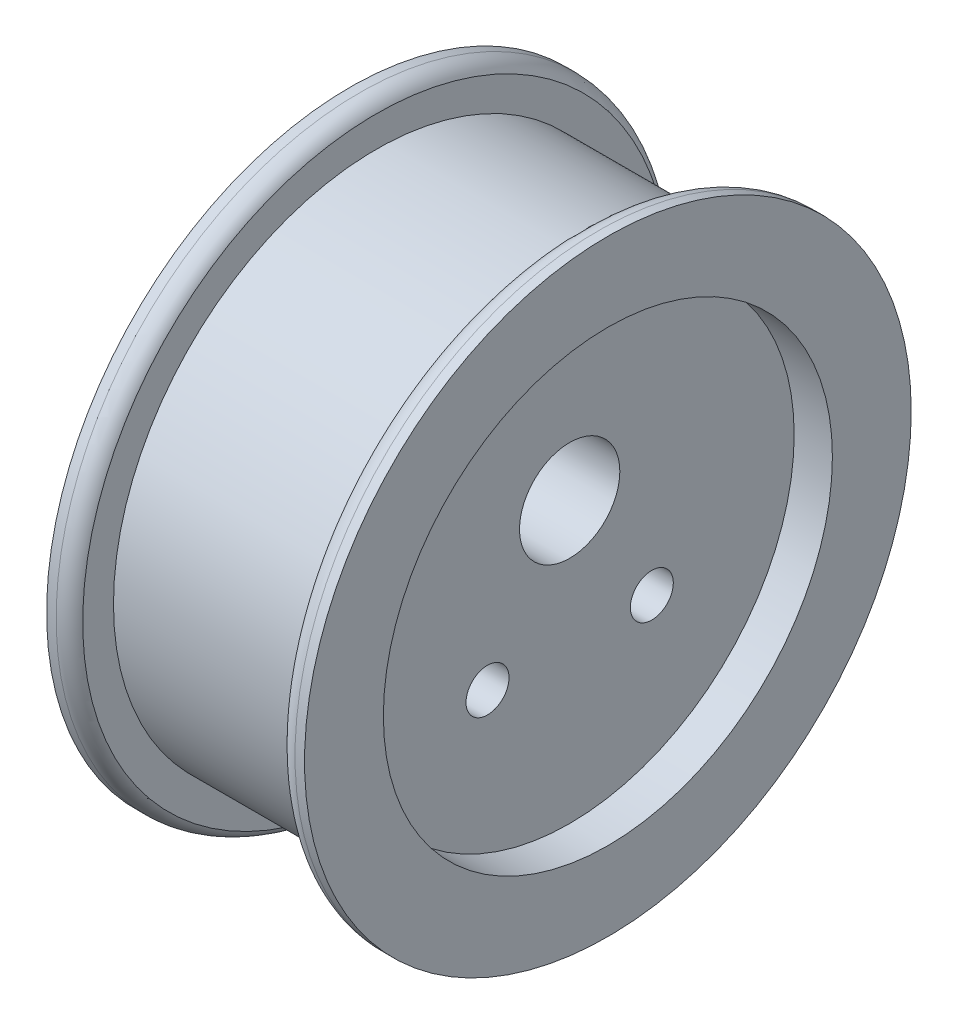
ISO-10303-21;
HEADER;
FILE_DESCRIPTION(('STEP AP214'),'2;1');
FILE_NAME('part.step','',(''),(''),'','','');
FILE_SCHEMA(('AUTOMOTIVE_DESIGN { 1 0 10303 214 1 1 1 1 }'));
ENDSEC;
DATA;
#1=APPLICATION_CONTEXT('core data for automotive mechanical design processes');
#2=APPLICATION_PROTOCOL_DEFINITION('international standard','automotive_design',2000,#1);
#3=PRODUCT_CONTEXT('',#1,'mechanical');
#4=PRODUCT('Part','Part','',(#3));
#5=PRODUCT_RELATED_PRODUCT_CATEGORY('part','',(#4));
#6=PRODUCT_DEFINITION_FORMATION('','',#4);
#7=PRODUCT_DEFINITION_CONTEXT('part definition',#1,'design');
#8=PRODUCT_DEFINITION('design','',#6,#7);
#9=PRODUCT_DEFINITION_SHAPE('','',#8);
#10=(LENGTH_UNIT() NAMED_UNIT(*) SI_UNIT(.MILLI.,.METRE.));
#11=(NAMED_UNIT(*) PLANE_ANGLE_UNIT() SI_UNIT($,.RADIAN.));
#12=(NAMED_UNIT(*) SI_UNIT($,.STERADIAN.) SOLID_ANGLE_UNIT());
#13=UNCERTAINTY_MEASURE_WITH_UNIT(LENGTH_MEASURE(1.E-05),#10,'distance_accuracy_value','');
#14=(GEOMETRIC_REPRESENTATION_CONTEXT(3) GLOBAL_UNCERTAINTY_ASSIGNED_CONTEXT((#13)) GLOBAL_UNIT_ASSIGNED_CONTEXT((#10,
#11,#12)) REPRESENTATION_CONTEXT('',''));
#15=CARTESIAN_POINT('',(0.,0.,0.));
#16=DIRECTION('',(0.,0.,1.));
#17=DIRECTION('',(1.,0.,0.));
#18=AXIS2_PLACEMENT_3D('',#15,#16,#17);
#19=CARTESIAN_POINT('',(3.,0.,0.));
#20=DIRECTION('',(1.,0.,0.));
#21=DIRECTION('',(0.,0.,-1.));
#22=AXIS2_PLACEMENT_3D('',#19,#20,#21);
#23=TOROIDAL_SURFACE('',#22,29.75,2.);
#24=CARTESIAN_POINT('',(3.,0.,0.));
#25=DIRECTION('',(1.,0.,0.));
#26=DIRECTION('',(0.,0.,-1.));
#27=AXIS2_PLACEMENT_3D('',#24,#25,#26);
#28=CIRCLE('',#27,31.75);
#29=CARTESIAN_POINT('',(3.,0.,-31.7500000000001));
#30=VERTEX_POINT('',#29);
#31=EDGE_CURVE('E104',#30,#30,#28,.T.);
#32=ORIENTED_EDGE('',*,*,#31,.F.);
#33=EDGE_LOOP('',(#32));
#34=FACE_BOUND('',#33,.T.);
#35=CARTESIAN_POINT('',(1.25,0.,0.));
#36=DIRECTION('',(-1.,0.,0.));
#37=DIRECTION('',(0.,0.,1.));
#38=AXIS2_PLACEMENT_3D('',#35,#36,#37);
#39=CIRCLE('',#38,30.7182458365519);
#40=CARTESIAN_POINT('',(1.25,0.,30.7182458365519));
#41=VERTEX_POINT('',#40);
#42=EDGE_CURVE('E48',#41,#41,#39,.F.);
#43=ORIENTED_EDGE('',*,*,#42,.T.);
#44=EDGE_LOOP('',(#43));
#45=FACE_BOUND('',#44,.T.);
#46=ADVANCED_FACE('F44',(#34,#45),#23,.T.);
#47=CARTESIAN_POINT('',(-22.,0.,0.));
#48=DIRECTION('',(1.,0.,0.));
#49=DIRECTION('',(0.,0.,-1.));
#50=AXIS2_PLACEMENT_3D('',#47,#48,#49);
#51=TOROIDAL_SURFACE('',#50,29.75,2.);
#52=CARTESIAN_POINT('',(-22.,0.,0.));
#53=DIRECTION('',(1.,0.,0.));
#54=DIRECTION('',(0.,0.,-1.));
#55=AXIS2_PLACEMENT_3D('',#52,#53,#54);
#56=CIRCLE('',#55,31.75);
#57=CARTESIAN_POINT('',(-22.,0.,-31.7500000000001));
#58=VERTEX_POINT('',#57);
#59=EDGE_CURVE('E101',#58,#58,#56,.T.);
#60=ORIENTED_EDGE('',*,*,#59,.T.);
#61=EDGE_LOOP('',(#60));
#62=FACE_BOUND('',#61,.T.);
#63=CARTESIAN_POINT('',(-20.25,0.,0.));
#64=DIRECTION('',(1.,0.,0.));
#65=DIRECTION('',(0.,0.,-1.));
#66=AXIS2_PLACEMENT_3D('',#63,#64,#65);
#67=CIRCLE('',#66,30.7182458365519);
#68=CARTESIAN_POINT('',(-20.25,0.,-30.7182458365519));
#69=VERTEX_POINT('',#68);
#70=EDGE_CURVE('E65',#69,#69,#67,.F.);
#71=ORIENTED_EDGE('',*,*,#70,.T.);
#72=EDGE_LOOP('',(#71));
#73=FACE_BOUND('',#72,.T.);
#74=ADVANCED_FACE('F128',(#62,#73),#51,.T.);
#75=CARTESIAN_POINT('',(0.,0.,0.));
#76=DIRECTION('',(1.,0.,0.));
#77=DIRECTION('',(0.,0.,-1.));
#78=AXIS2_PLACEMENT_3D('',#75,#76,#77);
#79=PLANE('',#78);
#80=CARTESIAN_POINT('',(0.,-7.09534799840619,-8.60000000000002));
#81=DIRECTION('',(1.,0.,0.));
#82=DIRECTION('',(0.,0.,-1.));
#83=AXIS2_PLACEMENT_3D('',#80,#81,#82);
#84=CIRCLE('',#83,2.25);
#85=CARTESIAN_POINT('',(0.,-7.09534799840619,-10.85));
#86=VERTEX_POINT('',#85);
#87=EDGE_CURVE('E71',#86,#86,#84,.T.);
#88=ORIENTED_EDGE('',*,*,#87,.F.);
#89=EDGE_LOOP('',(#88));
#90=FACE_BOUND('',#89,.T.);
#91=CARTESIAN_POINT('',(0.,-7.09534799840614,8.60000000000002));
#92=DIRECTION('',(1.,0.,0.));
#93=DIRECTION('',(0.,0.,-1.));
#94=AXIS2_PLACEMENT_3D('',#91,#92,#93);
#95=CIRCLE('',#94,2.25);
#96=CARTESIAN_POINT('',(0.,-7.09534799840614,6.35000000000001));
#97=VERTEX_POINT('',#96);
#98=EDGE_CURVE('E83',#97,#97,#95,.T.);
#99=ORIENTED_EDGE('',*,*,#98,.F.);
#100=EDGE_LOOP('',(#99));
#101=FACE_BOUND('',#100,.T.);
#102=CARTESIAN_POINT('',(0.,5.8,0.));
#103=DIRECTION('',(1.,0.,0.));
#104=DIRECTION('',(0.,0.,-1.));
#105=AXIS2_PLACEMENT_3D('',#102,#103,#104);
#106=CIRCLE('',#105,5.25);
#107=CARTESIAN_POINT('',(0.,5.8,-5.25000000000002));
#108=VERTEX_POINT('',#107);
#109=EDGE_CURVE('E64',#108,#108,#106,.T.);
#110=ORIENTED_EDGE('',*,*,#109,.F.);
#111=EDGE_LOOP('',(#110));
#112=FACE_BOUND('',#111,.T.);
#113=CARTESIAN_POINT('',(0.,0.,0.));
#114=DIRECTION('',(1.,0.,0.));
#115=DIRECTION('',(0.,0.,-1.));
#116=AXIS2_PLACEMENT_3D('',#113,#114,#115);
#117=CIRCLE('',#116,23.5);
#118=CARTESIAN_POINT('',(0.,0.,-23.5000000000001));
#119=VERTEX_POINT('',#118);
#120=EDGE_CURVE('E12',#119,#119,#117,.T.);
#121=ORIENTED_EDGE('',*,*,#120,.T.);
#122=EDGE_LOOP('',(#121));
#123=FACE_BOUND('',#122,.T.);
#124=ADVANCED_FACE('F46',(#90,#101,#112,#123),#79,.T.);
#125=CARTESIAN_POINT('',(15.3560429628506,0.,0.));
#126=DIRECTION('',(1.,0.,0.));
#127=DIRECTION('',(0.,0.,-1.));
#128=AXIS2_PLACEMENT_3D('',#125,#126,#127);
#129=CYLINDRICAL_SURFACE('',#128,23.5);
#130=CARTESIAN_POINT('',(4.,0.,0.));
#131=DIRECTION('',(1.,0.,0.));
#132=DIRECTION('',(0.,0.,-1.));
#133=AXIS2_PLACEMENT_3D('',#130,#131,#132);
#134=CIRCLE('',#133,23.5);
#135=CARTESIAN_POINT('',(4.,0.,-23.5000000000001));
#136=VERTEX_POINT('',#135);
#137=EDGE_CURVE('E52',#136,#136,#134,.T.);
#138=ORIENTED_EDGE('',*,*,#137,.T.);
#139=EDGE_LOOP('',(#138));
#140=FACE_BOUND('',#139,.T.);
#141=ORIENTED_EDGE('',*,*,#120,.F.);
#142=EDGE_LOOP('',(#141));
#143=FACE_BOUND('',#142,.T.);
#144=ADVANCED_FACE('F124',(#140,#143),#129,.F.);
#145=CARTESIAN_POINT('',(4.,23.5000000000001,0.));
#146=DIRECTION('',(1.,0.,0.));
#147=DIRECTION('',(0.,0.,-1.));
#148=AXIS2_PLACEMENT_3D('',#145,#146,#147);
#149=PLANE('',#148);
#150=CARTESIAN_POINT('',(4.,0.,0.));
#151=DIRECTION('',(1.,0.,0.));
#152=DIRECTION('',(0.,0.,-1.));
#153=AXIS2_PLACEMENT_3D('',#150,#151,#152);
#154=CIRCLE('',#153,31.75);
#155=CARTESIAN_POINT('',(4.,0.,-31.7500000000001));
#156=VERTEX_POINT('',#155);
#157=EDGE_CURVE('E57',#156,#156,#154,.T.);
#158=ORIENTED_EDGE('',*,*,#157,.T.);
#159=EDGE_LOOP('',(#158));
#160=FACE_BOUND('',#159,.T.);
#161=ORIENTED_EDGE('',*,*,#137,.F.);
#162=EDGE_LOOP('',(#161));
#163=FACE_BOUND('',#162,.T.);
#164=ADVANCED_FACE('F109',(#160,#163),#149,.T.);
#165=CARTESIAN_POINT('',(15.3560429628506,0.,0.));
#166=DIRECTION('',(1.,0.,0.));
#167=DIRECTION('',(0.,0.,-1.));
#168=AXIS2_PLACEMENT_3D('',#165,#166,#167);
#169=CYLINDRICAL_SURFACE('',#168,31.75);
#170=ORIENTED_EDGE('',*,*,#31,.T.);
#171=EDGE_LOOP('',(#170));
#172=FACE_BOUND('',#171,.T.);
#173=ORIENTED_EDGE('',*,*,#157,.F.);
#174=EDGE_LOOP('',(#173));
#175=FACE_BOUND('',#174,.T.);
#176=ADVANCED_FACE('F112',(#172,#175),#169,.T.);
#177=CARTESIAN_POINT('',(15.3560429628506,0.,0.));
#178=DIRECTION('',(1.,0.,0.));
#179=DIRECTION('',(0.,0.,-1.));
#180=AXIS2_PLACEMENT_3D('',#177,#178,#179);
#181=CYLINDRICAL_SURFACE('',#180,31.75);
#182=CARTESIAN_POINT('',(-23.,0.,0.));
#183=DIRECTION('',(1.,0.,0.));
#184=DIRECTION('',(0.,0.,-1.));
#185=AXIS2_PLACEMENT_3D('',#182,#183,#184);
#186=CIRCLE('',#185,31.75);
#187=CARTESIAN_POINT('',(-23.,0.,-31.7500000000001));
#188=VERTEX_POINT('',#187);
#189=EDGE_CURVE('E98',#188,#188,#186,.T.);
#190=ORIENTED_EDGE('',*,*,#189,.T.);
#191=EDGE_LOOP('',(#190));
#192=FACE_BOUND('',#191,.T.);
#193=ORIENTED_EDGE('',*,*,#59,.F.);
#194=EDGE_LOOP('',(#193));
#195=FACE_BOUND('',#194,.T.);
#196=ADVANCED_FACE('F114',(#192,#195),#181,.T.);
#197=CARTESIAN_POINT('',(-23.,23.5000000000001,0.));
#198=DIRECTION('',(-1.,0.,0.));
#199=DIRECTION('',(0.,0.,1.));
#200=AXIS2_PLACEMENT_3D('',#197,#198,#199);
#201=PLANE('',#200);
#202=CARTESIAN_POINT('',(-23.,0.,0.));
#203=DIRECTION('',(1.,0.,0.));
#204=DIRECTION('',(0.,0.,-1.));
#205=AXIS2_PLACEMENT_3D('',#202,#203,#204);
#206=CIRCLE('',#205,23.5);
#207=CARTESIAN_POINT('',(-23.,0.,-23.5000000000001));
#208=VERTEX_POINT('',#207);
#209=EDGE_CURVE('E95',#208,#208,#206,.T.);
#210=ORIENTED_EDGE('',*,*,#209,.T.);
#211=EDGE_LOOP('',(#210));
#212=FACE_BOUND('',#211,.T.);
#213=ORIENTED_EDGE('',*,*,#189,.F.);
#214=EDGE_LOOP('',(#213));
#215=FACE_BOUND('',#214,.T.);
#216=ADVANCED_FACE('F121',(#212,#215),#201,.T.);
#217=CARTESIAN_POINT('',(15.3560429628506,0.,0.));
#218=DIRECTION('',(1.,0.,0.));
#219=DIRECTION('',(0.,0.,-1.));
#220=AXIS2_PLACEMENT_3D('',#217,#218,#219);
#221=CYLINDRICAL_SURFACE('',#220,23.5);
#222=CARTESIAN_POINT('',(-19.,0.,0.));
#223=DIRECTION('',(1.,0.,0.));
#224=DIRECTION('',(0.,0.,-1.));
#225=AXIS2_PLACEMENT_3D('',#222,#223,#224);
#226=CIRCLE('',#225,23.5);
#227=CARTESIAN_POINT('',(-19.,0.,-23.5000000000001));
#228=VERTEX_POINT('',#227);
#229=EDGE_CURVE('E63',#228,#228,#226,.T.);
#230=ORIENTED_EDGE('',*,*,#229,.T.);
#231=EDGE_LOOP('',(#230));
#232=FACE_BOUND('',#231,.T.);
#233=ORIENTED_EDGE('',*,*,#209,.F.);
#234=EDGE_LOOP('',(#233));
#235=FACE_BOUND('',#234,.T.);
#236=ADVANCED_FACE('F146',(#232,#235),#221,.F.);
#237=CARTESIAN_POINT('',(-19.,0.,0.));
#238=DIRECTION('',(-1.,0.,0.));
#239=DIRECTION('',(0.,0.,1.));
#240=AXIS2_PLACEMENT_3D('',#237,#238,#239);
#241=PLANE('',#240);
#242=CARTESIAN_POINT('',(-19.,5.8,0.));
#243=DIRECTION('',(-1.,0.,0.));
#244=DIRECTION('',(0.,0.,1.));
#245=AXIS2_PLACEMENT_3D('',#242,#243,#244);
#246=CIRCLE('',#245,5.25);
#247=CARTESIAN_POINT('',(-19.,5.8,5.25000000000001));
#248=VERTEX_POINT('',#247);
#249=EDGE_CURVE('E61',#248,#248,#246,.T.);
#250=ORIENTED_EDGE('',*,*,#249,.F.);
#251=EDGE_LOOP('',(#250));
#252=FACE_BOUND('',#251,.T.);
#253=ORIENTED_EDGE('',*,*,#229,.F.);
#254=EDGE_LOOP('',(#253));
#255=FACE_BOUND('',#254,.T.);
#256=ADVANCED_FACE('F150',(#252,#255),#241,.T.);
#257=CARTESIAN_POINT('',(-23.,5.8,0.));
#258=DIRECTION('',(1.,0.,0.));
#259=DIRECTION('',(0.,0.,-1.));
#260=AXIS2_PLACEMENT_3D('',#257,#258,#259);
#261=CYLINDRICAL_SURFACE('',#260,5.25);
#262=ORIENTED_EDGE('',*,*,#249,.T.);
#263=EDGE_LOOP('',(#262));
#264=FACE_BOUND('',#263,.T.);
#265=ORIENTED_EDGE('',*,*,#109,.T.);
#266=EDGE_LOOP('',(#265));
#267=FACE_BOUND('',#266,.T.);
#268=ADVANCED_FACE('F154',(#264,#267),#261,.F.);
#269=CARTESIAN_POINT('',(-8.,-7.09534799840614,8.60000000000002));
#270=DIRECTION('',(1.,0.,0.));
#271=DIRECTION('',(0.,0.,-1.));
#272=AXIS2_PLACEMENT_3D('',#269,#270,#271);
#273=CYLINDRICAL_SURFACE('',#272,2.25);
#274=CARTESIAN_POINT('',(-8.,-7.09534799840614,8.60000000000002));
#275=DIRECTION('',(1.,0.,0.));
#276=DIRECTION('',(0.,0.,-1.));
#277=AXIS2_PLACEMENT_3D('',#274,#275,#276);
#278=CIRCLE('',#277,2.25);
#279=CARTESIAN_POINT('',(-8.,-7.09534799840614,6.35000000000001));
#280=VERTEX_POINT('',#279);
#281=EDGE_CURVE('E86',#280,#280,#278,.T.);
#282=ORIENTED_EDGE('',*,*,#281,.F.);
#283=EDGE_LOOP('',(#282));
#284=FACE_BOUND('',#283,.T.);
#285=ORIENTED_EDGE('',*,*,#98,.T.);
#286=EDGE_LOOP('',(#285));
#287=FACE_BOUND('',#286,.T.);
#288=ADVANCED_FACE('F158',(#284,#287),#273,.F.);
#289=CARTESIAN_POINT('',(-8.,-7.09534799840614,8.60000000000002));
#290=DIRECTION('',(1.,0.,0.));
#291=DIRECTION('',(0.,0.,-1.));
#292=AXIS2_PLACEMENT_3D('',#289,#290,#291);
#293=PLANE('',#292);
#294=ORIENTED_EDGE('',*,*,#281,.T.);
#295=EDGE_LOOP('',(#294));
#296=FACE_BOUND('',#295,.T.);
#297=ADVANCED_FACE('F162',(#296),#293,.T.);
#298=CARTESIAN_POINT('',(-8.,-7.09534799840619,-8.60000000000002));
#299=DIRECTION('',(1.,0.,0.));
#300=DIRECTION('',(0.,0.,-1.));
#301=AXIS2_PLACEMENT_3D('',#298,#299,#300);
#302=CYLINDRICAL_SURFACE('',#301,2.25);
#303=CARTESIAN_POINT('',(-8.,-7.09534799840619,-8.60000000000002));
#304=DIRECTION('',(1.,0.,0.));
#305=DIRECTION('',(0.,0.,-1.));
#306=AXIS2_PLACEMENT_3D('',#303,#304,#305);
#307=CIRCLE('',#306,2.25);
#308=CARTESIAN_POINT('',(-8.,-7.09534799840619,-10.85));
#309=VERTEX_POINT('',#308);
#310=EDGE_CURVE('E80',#309,#309,#307,.T.);
#311=ORIENTED_EDGE('',*,*,#310,.F.);
#312=EDGE_LOOP('',(#311));
#313=FACE_BOUND('',#312,.T.);
#314=ORIENTED_EDGE('',*,*,#87,.T.);
#315=EDGE_LOOP('',(#314));
#316=FACE_BOUND('',#315,.T.);
#317=ADVANCED_FACE('F166',(#313,#316),#302,.F.);
#318=CARTESIAN_POINT('',(-8.,-7.09534799840619,-8.60000000000002));
#319=DIRECTION('',(1.,0.,0.));
#320=DIRECTION('',(0.,0.,-1.));
#321=AXIS2_PLACEMENT_3D('',#318,#319,#320);
#322=PLANE('',#321);
#323=ORIENTED_EDGE('',*,*,#310,.T.);
#324=EDGE_LOOP('',(#323));
#325=FACE_BOUND('',#324,.T.);
#326=ADVANCED_FACE('F170',(#325),#322,.T.);
#327=CARTESIAN_POINT('',(-20.25,27.5000000000001,0.));
#328=DIRECTION('',(1.,0.,0.));
#329=DIRECTION('',(0.,0.,-1.));
#330=AXIS2_PLACEMENT_3D('',#327,#328,#329);
#331=PLANE('',#330);
#332=ORIENTED_EDGE('',*,*,#70,.F.);
#333=EDGE_LOOP('',(#332));
#334=FACE_BOUND('',#333,.T.);
#335=CARTESIAN_POINT('',(-20.25,0.,0.));
#336=DIRECTION('',(-1.,0.,0.));
#337=DIRECTION('',(0.,0.,1.));
#338=AXIS2_PLACEMENT_3D('',#335,#336,#337);
#339=CIRCLE('',#338,27.5);
#340=CARTESIAN_POINT('',(-20.25,0.,27.5000000000001));
#341=VERTEX_POINT('',#340);
#342=EDGE_CURVE('E73',#341,#341,#339,.T.);
#343=ORIENTED_EDGE('',*,*,#342,.T.);
#344=EDGE_LOOP('',(#343));
#345=FACE_BOUND('',#344,.T.);
#346=ADVANCED_FACE('F141',(#334,#345),#331,.T.);
#347=CARTESIAN_POINT('',(15.3560429628506,0.,0.));
#348=DIRECTION('',(1.,0.,0.));
#349=DIRECTION('',(0.,0.,-1.));
#350=AXIS2_PLACEMENT_3D('',#347,#348,#349);
#351=CYLINDRICAL_SURFACE('',#350,27.5);
#352=ORIENTED_EDGE('',*,*,#342,.F.);
#353=EDGE_LOOP('',(#352));
#354=FACE_BOUND('',#353,.T.);
#355=CARTESIAN_POINT('',(1.25,0.,0.));
#356=DIRECTION('',(-1.,0.,0.));
#357=DIRECTION('',(0.,0.,1.));
#358=AXIS2_PLACEMENT_3D('',#355,#356,#357);
#359=CIRCLE('',#358,27.5);
#360=CARTESIAN_POINT('',(1.25,0.,27.5000000000001));
#361=VERTEX_POINT('',#360);
#362=EDGE_CURVE('E67',#361,#361,#359,.T.);
#363=ORIENTED_EDGE('',*,*,#362,.T.);
#364=EDGE_LOOP('',(#363));
#365=FACE_BOUND('',#364,.T.);
#366=ADVANCED_FACE('F138',(#354,#365),#351,.T.);
#367=CARTESIAN_POINT('',(1.25,36.6376846848936,0.));
#368=DIRECTION('',(-1.,0.,0.));
#369=DIRECTION('',(0.,0.,1.));
#370=AXIS2_PLACEMENT_3D('',#367,#368,#369);
#371=PLANE('',#370);
#372=ORIENTED_EDGE('',*,*,#42,.F.);
#373=EDGE_LOOP('',(#372));
#374=FACE_BOUND('',#373,.T.);
#375=ORIENTED_EDGE('',*,*,#362,.F.);
#376=EDGE_LOOP('',(#375));
#377=FACE_BOUND('',#376,.T.);
#378=ADVANCED_FACE('F140',(#374,#377),#371,.T.);
#379=CLOSED_SHELL('',(#46,#74,#124,#144,#164,#176,#196,#216,#236,#256,#268,#288,#297,#317,#326,
#346,#366,#378));
#380=MANIFOLD_SOLID_BREP('B2',#379);
#381=ADVANCED_BREP_SHAPE_REPRESENTATION('',(#18,#380),#14);
#382=SHAPE_DEFINITION_REPRESENTATION(#9,#381);
ENDSEC;
END-ISO-10303-21;
